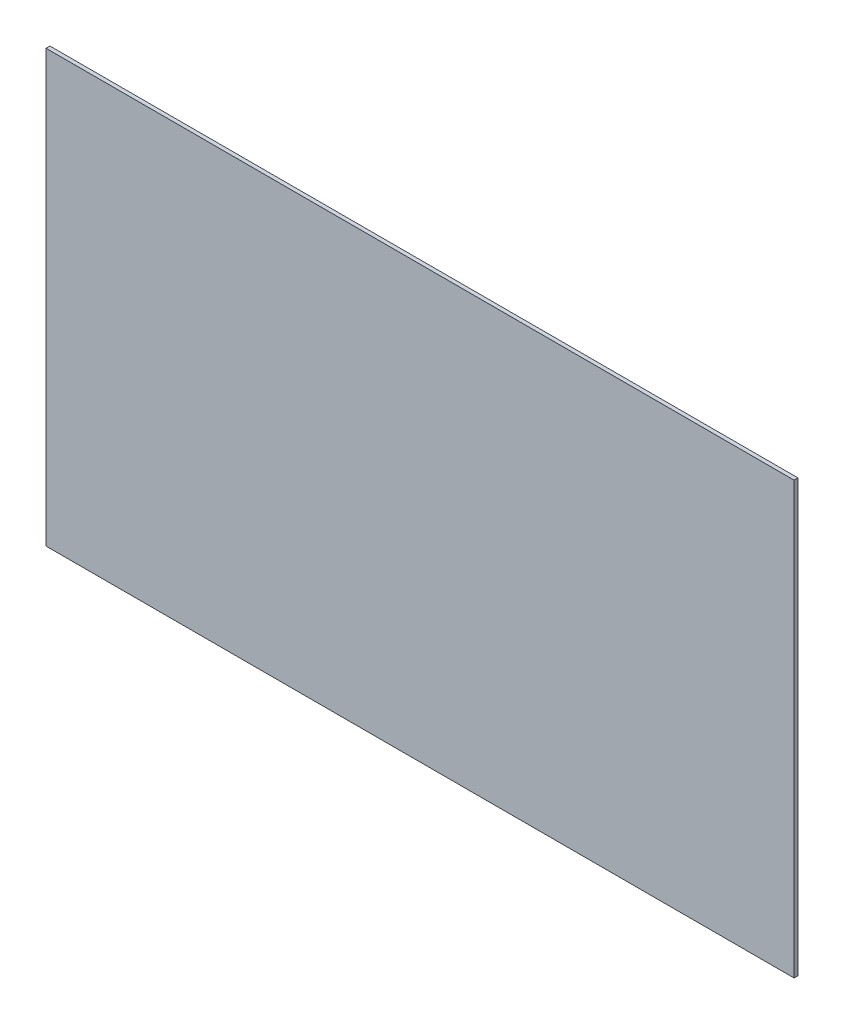
ISO-10303-21;
HEADER;
FILE_DESCRIPTION(('STEP AP214'),'2;1');
FILE_NAME('part.step','',(''),(''),'','','');
FILE_SCHEMA(('AUTOMOTIVE_DESIGN { 1 0 10303 214 1 1 1 1 }'));
ENDSEC;
DATA;
#1=APPLICATION_CONTEXT('core data for automotive mechanical design processes');
#2=APPLICATION_PROTOCOL_DEFINITION('international standard','automotive_design',2000,#1);
#3=PRODUCT_CONTEXT('',#1,'mechanical');
#4=PRODUCT('Part','Part','',(#3));
#5=PRODUCT_RELATED_PRODUCT_CATEGORY('part','',(#4));
#6=PRODUCT_DEFINITION_FORMATION('','',#4);
#7=PRODUCT_DEFINITION_CONTEXT('part definition',#1,'design');
#8=PRODUCT_DEFINITION('design','',#6,#7);
#9=PRODUCT_DEFINITION_SHAPE('','',#8);
#10=(LENGTH_UNIT() NAMED_UNIT(*) SI_UNIT(.MILLI.,.METRE.));
#11=(NAMED_UNIT(*) PLANE_ANGLE_UNIT() SI_UNIT($,.RADIAN.));
#12=(NAMED_UNIT(*) SI_UNIT($,.STERADIAN.) SOLID_ANGLE_UNIT());
#13=UNCERTAINTY_MEASURE_WITH_UNIT(LENGTH_MEASURE(1.E-05),#10,'distance_accuracy_value','');
#14=(GEOMETRIC_REPRESENTATION_CONTEXT(3) GLOBAL_UNCERTAINTY_ASSIGNED_CONTEXT((#13)) GLOBAL_UNIT_ASSIGNED_CONTEXT((#10,
#11,#12)) REPRESENTATION_CONTEXT('',''));
#15=CARTESIAN_POINT('',(0.,0.,0.));
#16=DIRECTION('',(0.,0.,1.));
#17=DIRECTION('',(1.,0.,0.));
#18=AXIS2_PLACEMENT_3D('',#15,#16,#17);
#19=CARTESIAN_POINT('',(0.,0.,9.525));
#20=DIRECTION('',(1.,0.,0.));
#21=DIRECTION('',(0.,0.,-1.));
#22=AXIS2_PLACEMENT_3D('',#19,#20,#21);
#23=PLANE('',#22);
#24=DIRECTION('',(0.,-1.,0.));
#25=VECTOR('',#24,1.);
#26=CARTESIAN_POINT('',(0.,0.,0.));
#27=LINE('',#26,#25);
#28=CARTESIAN_POINT('',(0.,1054.1,0.));
#29=VERTEX_POINT('',#28);
#30=CARTESIAN_POINT('',(0.,0.,0.));
#31=VERTEX_POINT('',#30);
#32=EDGE_CURVE('E95',#29,#31,#27,.T.);
#33=ORIENTED_EDGE('',*,*,#32,.T.);
#34=DIRECTION('',(0.,0.,-1.));
#35=VECTOR('',#34,1.);
#36=CARTESIAN_POINT('',(0.,0.,9.525));
#37=LINE('',#36,#35);
#38=CARTESIAN_POINT('',(0.,0.,9.525));
#39=VERTEX_POINT('',#38);
#40=EDGE_CURVE('E11',#39,#31,#37,.T.);
#41=ORIENTED_EDGE('',*,*,#40,.F.);
#42=DIRECTION('',(0.,-1.,0.));
#43=VECTOR('',#42,1.);
#44=CARTESIAN_POINT('',(0.,0.,9.525));
#45=LINE('',#44,#43);
#46=CARTESIAN_POINT('',(0.,1054.1,9.525));
#47=VERTEX_POINT('',#46);
#48=EDGE_CURVE('E83',#47,#39,#45,.T.);
#49=ORIENTED_EDGE('',*,*,#48,.F.);
#50=DIRECTION('',(0.,0.,-1.));
#51=VECTOR('',#50,1.);
#52=CARTESIAN_POINT('',(0.,1054.1,9.525));
#53=LINE('',#52,#51);
#54=EDGE_CURVE('E91',#47,#29,#53,.T.);
#55=ORIENTED_EDGE('',*,*,#54,.T.);
#56=EDGE_LOOP('',(#33,#41,#49,#55));
#57=FACE_BOUND('',#56,.T.);
#58=ADVANCED_FACE('F32',(#57),#23,.F.);
#59=CARTESIAN_POINT('',(0.,0.,9.525));
#60=DIRECTION('',(0.,1.,0.));
#61=DIRECTION('',(0.,0.,1.));
#62=AXIS2_PLACEMENT_3D('',#59,#60,#61);
#63=PLANE('',#62);
#64=DIRECTION('',(1.,0.,0.));
#65=VECTOR('',#64,1.);
#66=CARTESIAN_POINT('',(0.,0.,0.));
#67=LINE('',#66,#65);
#68=CARTESIAN_POINT('',(1828.8,0.,0.));
#69=VERTEX_POINT('',#68);
#70=EDGE_CURVE('E87',#31,#69,#67,.T.);
#71=ORIENTED_EDGE('',*,*,#70,.T.);
#72=DIRECTION('',(0.,0.,-1.));
#73=VECTOR('',#72,1.);
#74=CARTESIAN_POINT('',(1828.8,0.,9.525));
#75=LINE('',#74,#73);
#76=CARTESIAN_POINT('',(1828.8,0.,9.525));
#77=VERTEX_POINT('',#76);
#78=EDGE_CURVE('E40',#77,#69,#75,.T.);
#79=ORIENTED_EDGE('',*,*,#78,.F.);
#80=DIRECTION('',(1.,0.,0.));
#81=VECTOR('',#80,1.);
#82=CARTESIAN_POINT('',(0.,0.,9.525));
#83=LINE('',#82,#81);
#84=EDGE_CURVE('E78',#39,#77,#83,.T.);
#85=ORIENTED_EDGE('',*,*,#84,.F.);
#86=ORIENTED_EDGE('',*,*,#40,.T.);
#87=EDGE_LOOP('',(#71,#79,#85,#86));
#88=FACE_BOUND('',#87,.T.);
#89=ADVANCED_FACE('F86',(#88),#63,.F.);
#90=CARTESIAN_POINT('',(1828.8,0.,9.525));
#91=DIRECTION('',(-1.,0.,0.));
#92=DIRECTION('',(0.,0.,1.));
#93=AXIS2_PLACEMENT_3D('',#90,#91,#92);
#94=PLANE('',#93);
#95=DIRECTION('',(0.,1.,0.));
#96=VECTOR('',#95,1.);
#97=CARTESIAN_POINT('',(1828.8,0.,0.));
#98=LINE('',#97,#96);
#99=CARTESIAN_POINT('',(1828.8,1054.1,0.));
#100=VERTEX_POINT('',#99);
#101=EDGE_CURVE('E65',#69,#100,#98,.T.);
#102=ORIENTED_EDGE('',*,*,#101,.T.);
#103=DIRECTION('',(0.,0.,-1.));
#104=VECTOR('',#103,1.);
#105=CARTESIAN_POINT('',(1828.8,1054.1,9.525));
#106=LINE('',#105,#104);
#107=CARTESIAN_POINT('',(1828.8,1054.1,9.525));
#108=VERTEX_POINT('',#107);
#109=EDGE_CURVE('E88',#108,#100,#106,.T.);
#110=ORIENTED_EDGE('',*,*,#109,.F.);
#111=DIRECTION('',(0.,1.,0.));
#112=VECTOR('',#111,1.);
#113=CARTESIAN_POINT('',(1828.8,0.,9.525));
#114=LINE('',#113,#112);
#115=EDGE_CURVE('E81',#77,#108,#114,.T.);
#116=ORIENTED_EDGE('',*,*,#115,.F.);
#117=ORIENTED_EDGE('',*,*,#78,.T.);
#118=EDGE_LOOP('',(#102,#110,#116,#117));
#119=FACE_BOUND('',#118,.T.);
#120=ADVANCED_FACE('F89',(#119),#94,.F.);
#121=CARTESIAN_POINT('',(0.,1054.1,9.525));
#122=DIRECTION('',(0.,-1.,0.));
#123=DIRECTION('',(0.,0.,-1.));
#124=AXIS2_PLACEMENT_3D('',#121,#122,#123);
#125=PLANE('',#124);
#126=DIRECTION('',(-1.,0.,0.));
#127=VECTOR('',#126,1.);
#128=CARTESIAN_POINT('',(0.,1054.1,0.));
#129=LINE('',#128,#127);
#130=EDGE_CURVE('E71',#100,#29,#129,.T.);
#131=ORIENTED_EDGE('',*,*,#130,.T.);
#132=ORIENTED_EDGE('',*,*,#54,.F.);
#133=DIRECTION('',(-1.,0.,0.));
#134=VECTOR('',#133,1.);
#135=CARTESIAN_POINT('',(0.,1054.1,9.525));
#136=LINE('',#135,#134);
#137=EDGE_CURVE('E48',#108,#47,#136,.T.);
#138=ORIENTED_EDGE('',*,*,#137,.F.);
#139=ORIENTED_EDGE('',*,*,#109,.T.);
#140=EDGE_LOOP('',(#131,#132,#138,#139));
#141=FACE_BOUND('',#140,.T.);
#142=ADVANCED_FACE('F102',(#141),#125,.F.);
#143=CARTESIAN_POINT('',(0.,0.,9.525));
#144=DIRECTION('',(0.,0.,-1.));
#145=DIRECTION('',(-1.,0.,0.));
#146=AXIS2_PLACEMENT_3D('',#143,#144,#145);
#147=PLANE('',#146);
#148=ORIENTED_EDGE('',*,*,#48,.T.);
#149=ORIENTED_EDGE('',*,*,#84,.T.);
#150=ORIENTED_EDGE('',*,*,#115,.T.);
#151=ORIENTED_EDGE('',*,*,#137,.T.);
#152=EDGE_LOOP('',(#148,#149,#150,#151));
#153=FACE_BOUND('',#152,.T.);
#154=ADVANCED_FACE('F79',(#153),#147,.F.);
#155=CARTESIAN_POINT('',(0.,0.,0.));
#156=DIRECTION('',(0.,0.,-1.));
#157=DIRECTION('',(-1.,0.,0.));
#158=AXIS2_PLACEMENT_3D('',#155,#156,#157);
#159=PLANE('',#158);
#160=ORIENTED_EDGE('',*,*,#32,.F.);
#161=ORIENTED_EDGE('',*,*,#130,.F.);
#162=ORIENTED_EDGE('',*,*,#101,.F.);
#163=ORIENTED_EDGE('',*,*,#70,.F.);
#164=EDGE_LOOP('',(#160,#161,#162,#163));
#165=FACE_BOUND('',#164,.T.);
#166=ADVANCED_FACE('F105',(#165),#159,.T.);
#167=CLOSED_SHELL('',(#58,#89,#120,#142,#154,#166));
#168=MANIFOLD_SOLID_BREP('B2',#167);
#169=ADVANCED_BREP_SHAPE_REPRESENTATION('',(#18,#168),#14);
#170=SHAPE_DEFINITION_REPRESENTATION(#9,#169);
ENDSEC;
END-ISO-10303-21;
